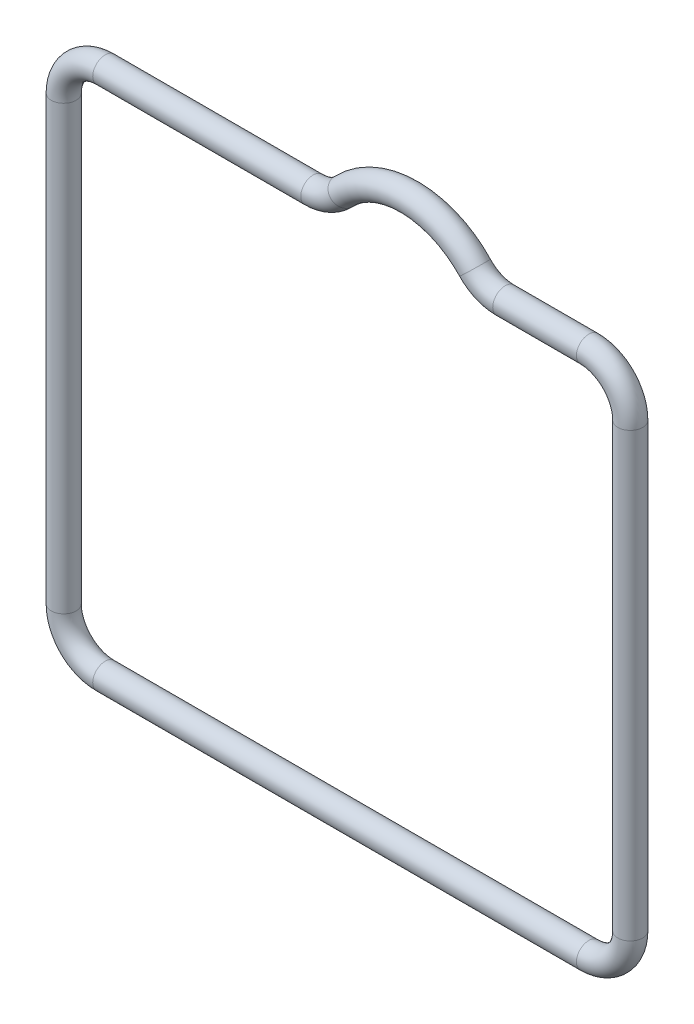
ISO-10303-21;
HEADER;
FILE_DESCRIPTION(('STEP AP214'),'2;1');
FILE_NAME('part.step','',(''),(''),'','','');
FILE_SCHEMA(('AUTOMOTIVE_DESIGN { 1 0 10303 214 1 1 1 1 }'));
ENDSEC;
DATA;
#1=APPLICATION_CONTEXT('core data for automotive mechanical design processes');
#2=APPLICATION_PROTOCOL_DEFINITION('international standard','automotive_design',2000,#1);
#3=PRODUCT_CONTEXT('',#1,'mechanical');
#4=PRODUCT('Part','Part','',(#3));
#5=PRODUCT_RELATED_PRODUCT_CATEGORY('part','',(#4));
#6=PRODUCT_DEFINITION_FORMATION('','',#4);
#7=PRODUCT_DEFINITION_CONTEXT('part definition',#1,'design');
#8=PRODUCT_DEFINITION('design','',#6,#7);
#9=PRODUCT_DEFINITION_SHAPE('','',#8);
#10=(LENGTH_UNIT() NAMED_UNIT(*) SI_UNIT(.MILLI.,.METRE.));
#11=(NAMED_UNIT(*) PLANE_ANGLE_UNIT() SI_UNIT($,.RADIAN.));
#12=(NAMED_UNIT(*) SI_UNIT($,.STERADIAN.) SOLID_ANGLE_UNIT());
#13=UNCERTAINTY_MEASURE_WITH_UNIT(LENGTH_MEASURE(1.E-05),#10,'distance_accuracy_value','');
#14=(GEOMETRIC_REPRESENTATION_CONTEXT(3) GLOBAL_UNCERTAINTY_ASSIGNED_CONTEXT((#13)) GLOBAL_UNIT_ASSIGNED_CONTEXT((#10,
#11,#12)) REPRESENTATION_CONTEXT('',''));
#15=CARTESIAN_POINT('',(0.,0.,0.));
#16=DIRECTION('',(0.,0.,1.));
#17=DIRECTION('',(1.,0.,0.));
#18=AXIS2_PLACEMENT_3D('',#15,#16,#17);
#19=CARTESIAN_POINT('',(3.,3.,0.));
#20=DIRECTION('',(0.,0.,-1.));
#21=DIRECTION('',(-1.,0.,0.));
#22=AXIS2_PLACEMENT_3D('',#19,#20,#21);
#23=TOROIDAL_SURFACE('',#22,3.,0.9);
#24=CARTESIAN_POINT('',(3.00000000000002,0.,0.));
#25=DIRECTION('',(-1.,0.,0.));
#26=DIRECTION('',(0.,0.,1.));
#27=AXIS2_PLACEMENT_3D('',#24,#25,#26);
#28=CIRCLE('',#27,0.9);
#29=CARTESIAN_POINT('',(3.00000000000003,-0.9,0.));
#30=VERTEX_POINT('',#29);
#31=EDGE_CURVE('E10',#30,#30,#28,.T.);
#32=CARTESIAN_POINT('',(0.,3.00000000000002,0.));
#33=DIRECTION('',(0.,1.,0.));
#34=DIRECTION('',(0.,0.,1.));
#35=AXIS2_PLACEMENT_3D('',#32,#33,#34);
#36=CIRCLE('',#35,0.9);
#37=CARTESIAN_POINT('',(-0.9,3.00000000000003,0.));
#38=VERTEX_POINT('',#37);
#39=EDGE_CURVE('E73',#38,#38,#36,.T.);
#40=CARTESIAN_POINT('',(3.,3.,0.));
#41=DIRECTION('',(0.,0.,-1.));
#42=DIRECTION('',(-1.,0.,0.));
#43=AXIS2_PLACEMENT_3D('',#40,#41,#42);
#44=CIRCLE('',#43,3.9);
#45=EDGE_CURVE('',#30,#38,#44,.T.);
#46=ORIENTED_EDGE('',*,*,#31,.T.);
#47=ORIENTED_EDGE('',*,*,#39,.F.);
#48=ORIENTED_EDGE('',*,*,#45,.T.);
#49=ORIENTED_EDGE('',*,*,#45,.F.);
#50=EDGE_LOOP('',(#46,#48,#47,#49));
#51=FACE_BOUND('',#50,.T.);
#52=ADVANCED_FACE('F33',(#51),#23,.T.);
#53=CARTESIAN_POINT('',(38.,0.,0.));
#54=DIRECTION('',(-1.,0.,0.));
#55=DIRECTION('',(0.,0.,1.));
#56=AXIS2_PLACEMENT_3D('',#53,#54,#55);
#57=CYLINDRICAL_SURFACE('',#56,0.9);
#58=ORIENTED_EDGE('',*,*,#31,.F.);
#59=EDGE_LOOP('',(#58));
#60=FACE_BOUND('',#59,.T.);
#61=CARTESIAN_POINT('',(38.,0.,0.));
#62=DIRECTION('',(-1.,0.,0.));
#63=DIRECTION('',(0.,0.,1.));
#64=AXIS2_PLACEMENT_3D('',#61,#62,#63);
#65=CIRCLE('',#64,0.9);
#66=CARTESIAN_POINT('',(38.,-0.900000000000002,0.));
#67=VERTEX_POINT('',#66);
#68=EDGE_CURVE('E39',#67,#67,#65,.T.);
#69=ORIENTED_EDGE('',*,*,#68,.T.);
#70=EDGE_LOOP('',(#69));
#71=FACE_BOUND('',#70,.T.);
#72=ADVANCED_FACE('F80',(#60,#71),#57,.T.);
#73=CARTESIAN_POINT('',(38.,3.,0.));
#74=DIRECTION('',(0.,0.,-1.));
#75=DIRECTION('',(-1.,0.,0.));
#76=AXIS2_PLACEMENT_3D('',#73,#74,#75);
#77=TOROIDAL_SURFACE('',#76,3.,0.9);
#78=CARTESIAN_POINT('',(41.,3.00000000000002,0.));
#79=DIRECTION('',(0.,-1.,0.));
#80=DIRECTION('',(0.,0.,1.));
#81=AXIS2_PLACEMENT_3D('',#78,#79,#80);
#82=CIRCLE('',#81,0.9);
#83=CARTESIAN_POINT('',(41.9,3.00000000000003,0.));
#84=VERTEX_POINT('',#83);
#85=EDGE_CURVE('E43',#84,#84,#82,.T.);
#86=CARTESIAN_POINT('',(38.,3.,0.));
#87=DIRECTION('',(0.,0.,-1.));
#88=DIRECTION('',(-1.,0.,0.));
#89=AXIS2_PLACEMENT_3D('',#86,#87,#88);
#90=CIRCLE('',#89,3.9);
#91=EDGE_CURVE('',#84,#67,#90,.T.);
#92=ORIENTED_EDGE('',*,*,#85,.T.);
#93=ORIENTED_EDGE('',*,*,#68,.F.);
#94=ORIENTED_EDGE('',*,*,#91,.T.);
#95=ORIENTED_EDGE('',*,*,#91,.F.);
#96=EDGE_LOOP('',(#92,#94,#93,#95));
#97=FACE_BOUND('',#96,.T.);
#98=ADVANCED_FACE('F84',(#97),#77,.T.);
#99=CARTESIAN_POINT('',(41.,35.,0.));
#100=DIRECTION('',(0.,-1.,0.));
#101=DIRECTION('',(0.,0.,-1.));
#102=AXIS2_PLACEMENT_3D('',#99,#100,#101);
#103=CYLINDRICAL_SURFACE('',#102,0.9);
#104=ORIENTED_EDGE('',*,*,#85,.F.);
#105=EDGE_LOOP('',(#104));
#106=FACE_BOUND('',#105,.T.);
#107=CARTESIAN_POINT('',(41.,35.,0.));
#108=DIRECTION('',(0.,-1.,0.));
#109=DIRECTION('',(0.,0.,1.));
#110=AXIS2_PLACEMENT_3D('',#107,#108,#109);
#111=CIRCLE('',#110,0.9);
#112=CARTESIAN_POINT('',(41.9,35.,0.));
#113=VERTEX_POINT('',#112);
#114=EDGE_CURVE('E47',#113,#113,#111,.T.);
#115=ORIENTED_EDGE('',*,*,#114,.T.);
#116=EDGE_LOOP('',(#115));
#117=FACE_BOUND('',#116,.T.);
#118=ADVANCED_FACE('F89',(#106,#117),#103,.T.);
#119=CARTESIAN_POINT('',(38.,35.,0.));
#120=DIRECTION('',(0.,0.,-1.));
#121=DIRECTION('',(-1.,0.,0.));
#122=AXIS2_PLACEMENT_3D('',#119,#120,#121);
#123=TOROIDAL_SURFACE('',#122,3.,0.9);
#124=CARTESIAN_POINT('',(38.,38.,0.));
#125=DIRECTION('',(1.,0.,0.));
#126=DIRECTION('',(0.,0.,1.));
#127=AXIS2_PLACEMENT_3D('',#124,#125,#126);
#128=CIRCLE('',#127,0.9);
#129=CARTESIAN_POINT('',(38.,38.9,0.));
#130=VERTEX_POINT('',#129);
#131=EDGE_CURVE('E52',#130,#130,#128,.T.);
#132=CARTESIAN_POINT('',(38.,35.,0.));
#133=DIRECTION('',(0.,0.,-1.));
#134=DIRECTION('',(-1.,0.,0.));
#135=AXIS2_PLACEMENT_3D('',#132,#133,#134);
#136=CIRCLE('',#135,3.9);
#137=EDGE_CURVE('',#130,#113,#136,.T.);
#138=ORIENTED_EDGE('',*,*,#131,.T.);
#139=ORIENTED_EDGE('',*,*,#114,.F.);
#140=ORIENTED_EDGE('',*,*,#137,.T.);
#141=ORIENTED_EDGE('',*,*,#137,.F.);
#142=EDGE_LOOP('',(#138,#140,#139,#141));
#143=FACE_BOUND('',#142,.T.);
#144=ADVANCED_FACE('F95',(#143),#123,.T.);
#145=CARTESIAN_POINT('',(31.9462219947249,38.,0.));
#146=DIRECTION('',(1.,0.,0.));
#147=DIRECTION('',(0.,0.,-1.));
#148=AXIS2_PLACEMENT_3D('',#145,#146,#147);
#149=CYLINDRICAL_SURFACE('',#148,0.9);
#150=ORIENTED_EDGE('',*,*,#131,.F.);
#151=EDGE_LOOP('',(#150));
#152=FACE_BOUND('',#151,.T.);
#153=CARTESIAN_POINT('',(31.9462219947249,38.,0.));
#154=DIRECTION('',(1.,0.,0.));
#155=DIRECTION('',(0.,0.,1.));
#156=AXIS2_PLACEMENT_3D('',#153,#154,#155);
#157=CIRCLE('',#156,0.9);
#158=CARTESIAN_POINT('',(31.9462219947249,37.1,0.));
#159=VERTEX_POINT('',#158);
#160=EDGE_CURVE('E55',#159,#159,#157,.T.);
#161=ORIENTED_EDGE('',*,*,#160,.T.);
#162=EDGE_LOOP('',(#161));
#163=FACE_BOUND('',#162,.T.);
#164=ADVANCED_FACE('F99',(#152,#163),#149,.T.);
#165=CARTESIAN_POINT('',(31.9462219947249,41.,0.));
#166=DIRECTION('',(0.,0.,1.));
#167=DIRECTION('',(1.,0.,0.));
#168=AXIS2_PLACEMENT_3D('',#165,#166,#167);
#169=TOROIDAL_SURFACE('',#168,3.,0.9);
#170=CARTESIAN_POINT('',(29.7622570007503,38.943231441048,0.));
#171=DIRECTION('',(0.685589519650656,-0.72798833132488,0.));
#172=DIRECTION('',(0.,0.,1.));
#173=AXIS2_PLACEMENT_3D('',#170,#171,#172);
#174=CIRCLE('',#173,0.9);
#175=CARTESIAN_POINT('',(29.1070675025579,38.3262008733624,0.));
#176=VERTEX_POINT('',#175);
#177=EDGE_CURVE('E58',#176,#176,#174,.T.);
#178=CARTESIAN_POINT('',(31.9462219947249,41.,0.));
#179=DIRECTION('',(0.,0.,1.));
#180=DIRECTION('',(1.,0.,0.));
#181=AXIS2_PLACEMENT_3D('',#178,#179,#180);
#182=CIRCLE('',#181,3.9);
#183=EDGE_CURVE('',#176,#159,#182,.T.);
#184=ORIENTED_EDGE('',*,*,#177,.T.);
#185=ORIENTED_EDGE('',*,*,#160,.F.);
#186=ORIENTED_EDGE('',*,*,#183,.T.);
#187=ORIENTED_EDGE('',*,*,#183,.F.);
#188=EDGE_LOOP('',(#184,#186,#185,#187));
#189=FACE_BOUND('',#188,.T.);
#190=ADVANCED_FACE('F103',(#189),#169,.T.);
#191=CARTESIAN_POINT('',(25.,34.4583333333333,0.));
#192=DIRECTION('',(0.,0.,-1.));
#193=DIRECTION('',(-1.,0.,0.));
#194=AXIS2_PLACEMENT_3D('',#191,#192,#193);
#195=TOROIDAL_SURFACE('',#194,6.54166666666667,0.9);
#196=ORIENTED_EDGE('',*,*,#177,.F.);
#197=EDGE_LOOP('',(#196));
#198=FACE_BOUND('',#197,.T.);
#199=CARTESIAN_POINT('',(20.2377429992497,38.943231441048,0.));
#200=DIRECTION('',(0.685589519650656,0.72798833132488,0.));
#201=DIRECTION('',(0.,0.,1.));
#202=AXIS2_PLACEMENT_3D('',#199,#200,#201);
#203=CIRCLE('',#202,0.9);
#204=CARTESIAN_POINT('',(20.8929324974421,38.3262008733624,0.));
#205=VERTEX_POINT('',#204);
#206=EDGE_CURVE('E61',#205,#205,#203,.T.);
#207=ORIENTED_EDGE('',*,*,#206,.T.);
#208=EDGE_LOOP('',(#207));
#209=FACE_BOUND('',#208,.T.);
#210=ADVANCED_FACE('F107',(#198,#209),#195,.T.);
#211=CARTESIAN_POINT('',(18.0537780052751,41.,0.));
#212=DIRECTION('',(0.,0.,1.));
#213=DIRECTION('',(1.,0.,0.));
#214=AXIS2_PLACEMENT_3D('',#211,#212,#213);
#215=TOROIDAL_SURFACE('',#214,3.,0.9);
#216=CARTESIAN_POINT('',(18.0537780052751,38.,0.));
#217=DIRECTION('',(1.,0.,0.));
#218=DIRECTION('',(0.,0.,1.));
#219=AXIS2_PLACEMENT_3D('',#216,#217,#218);
#220=CIRCLE('',#219,0.9);
#221=CARTESIAN_POINT('',(18.0537780052751,37.1,0.));
#222=VERTEX_POINT('',#221);
#223=EDGE_CURVE('E64',#222,#222,#220,.T.);
#224=CARTESIAN_POINT('',(18.0537780052751,41.,0.));
#225=DIRECTION('',(0.,0.,1.));
#226=DIRECTION('',(1.,0.,0.));
#227=AXIS2_PLACEMENT_3D('',#224,#225,#226);
#228=CIRCLE('',#227,3.9);
#229=EDGE_CURVE('',#222,#205,#228,.T.);
#230=ORIENTED_EDGE('',*,*,#223,.T.);
#231=ORIENTED_EDGE('',*,*,#206,.F.);
#232=ORIENTED_EDGE('',*,*,#229,.T.);
#233=ORIENTED_EDGE('',*,*,#229,.F.);
#234=EDGE_LOOP('',(#230,#232,#231,#233));
#235=FACE_BOUND('',#234,.T.);
#236=ADVANCED_FACE('F111',(#235),#215,.T.);
#237=CARTESIAN_POINT('',(3.00000000000002,38.,0.));
#238=DIRECTION('',(1.,0.,0.));
#239=DIRECTION('',(0.,0.,-1.));
#240=AXIS2_PLACEMENT_3D('',#237,#238,#239);
#241=CYLINDRICAL_SURFACE('',#240,0.9);
#242=ORIENTED_EDGE('',*,*,#223,.F.);
#243=EDGE_LOOP('',(#242));
#244=FACE_BOUND('',#243,.T.);
#245=CARTESIAN_POINT('',(3.00000000000002,38.,0.));
#246=DIRECTION('',(1.,0.,0.));
#247=DIRECTION('',(0.,0.,1.));
#248=AXIS2_PLACEMENT_3D('',#245,#246,#247);
#249=CIRCLE('',#248,0.9);
#250=CARTESIAN_POINT('',(3.00000000000003,38.9,0.));
#251=VERTEX_POINT('',#250);
#252=EDGE_CURVE('E67',#251,#251,#249,.T.);
#253=ORIENTED_EDGE('',*,*,#252,.T.);
#254=EDGE_LOOP('',(#253));
#255=FACE_BOUND('',#254,.T.);
#256=ADVANCED_FACE('F115',(#244,#255),#241,.T.);
#257=CARTESIAN_POINT('',(3.,35.,0.));
#258=DIRECTION('',(0.,0.,-1.));
#259=DIRECTION('',(-1.,0.,0.));
#260=AXIS2_PLACEMENT_3D('',#257,#258,#259);
#261=TOROIDAL_SURFACE('',#260,2.99999999999998,0.9);
#262=CARTESIAN_POINT('',(0.,35.,0.));
#263=DIRECTION('',(0.,1.,0.));
#264=DIRECTION('',(0.,0.,1.));
#265=AXIS2_PLACEMENT_3D('',#262,#263,#264);
#266=CIRCLE('',#265,0.9);
#267=CARTESIAN_POINT('',(-0.899999999999981,35.,0.));
#268=VERTEX_POINT('',#267);
#269=EDGE_CURVE('E70',#268,#268,#266,.T.);
#270=CARTESIAN_POINT('',(3.,35.,0.));
#271=DIRECTION('',(0.,0.,-1.));
#272=DIRECTION('',(-1.,0.,0.));
#273=AXIS2_PLACEMENT_3D('',#270,#271,#272);
#274=CIRCLE('',#273,3.89999999999998);
#275=EDGE_CURVE('',#268,#251,#274,.T.);
#276=ORIENTED_EDGE('',*,*,#269,.T.);
#277=ORIENTED_EDGE('',*,*,#252,.F.);
#278=ORIENTED_EDGE('',*,*,#275,.T.);
#279=ORIENTED_EDGE('',*,*,#275,.F.);
#280=EDGE_LOOP('',(#276,#278,#277,#279));
#281=FACE_BOUND('',#280,.T.);
#282=ADVANCED_FACE('F119',(#281),#261,.T.);
#283=CARTESIAN_POINT('',(0.,3.00000000000002,0.));
#284=DIRECTION('',(0.,1.,0.));
#285=DIRECTION('',(0.,0.,1.));
#286=AXIS2_PLACEMENT_3D('',#283,#284,#285);
#287=CYLINDRICAL_SURFACE('',#286,0.9);
#288=ORIENTED_EDGE('',*,*,#269,.F.);
#289=EDGE_LOOP('',(#288));
#290=FACE_BOUND('',#289,.T.);
#291=ORIENTED_EDGE('',*,*,#39,.T.);
#292=EDGE_LOOP('',(#291));
#293=FACE_BOUND('',#292,.T.);
#294=ADVANCED_FACE('F77',(#290,#293),#287,.T.);
#295=CLOSED_SHELL('',(#52,#72,#98,#118,#144,#164,#190,#210,#236,#256,#282,#294));
#296=MANIFOLD_SOLID_BREP('B2',#295);
#297=ADVANCED_BREP_SHAPE_REPRESENTATION('',(#18,#296),#14);
#298=SHAPE_DEFINITION_REPRESENTATION(#9,#297);
ENDSEC;
END-ISO-10303-21;
